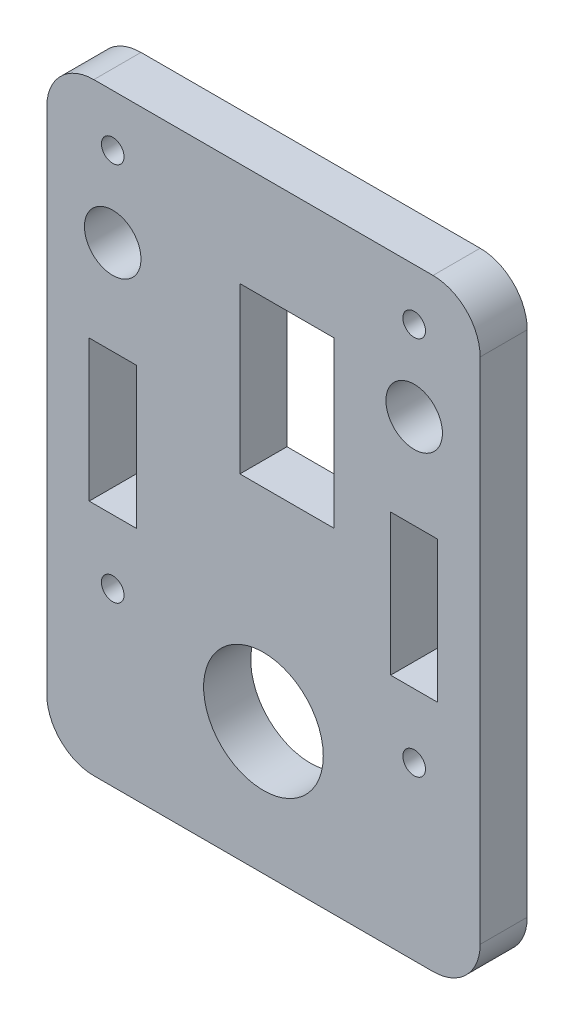
ISO-10303-21;
HEADER;
FILE_DESCRIPTION(('STEP AP214'),'2;1');
FILE_NAME('part.step','',(''),(''),'','','');
FILE_SCHEMA(('AUTOMOTIVE_DESIGN { 1 0 10303 214 1 1 1 1 }'));
ENDSEC;
DATA;
#1=APPLICATION_CONTEXT('core data for automotive mechanical design processes');
#2=APPLICATION_PROTOCOL_DEFINITION('international standard','automotive_design',2000,#1);
#3=PRODUCT_CONTEXT('',#1,'mechanical');
#4=PRODUCT('Part','Part','',(#3));
#5=PRODUCT_RELATED_PRODUCT_CATEGORY('part','',(#4));
#6=PRODUCT_DEFINITION_FORMATION('','',#4);
#7=PRODUCT_DEFINITION_CONTEXT('part definition',#1,'design');
#8=PRODUCT_DEFINITION('design','',#6,#7);
#9=PRODUCT_DEFINITION_SHAPE('','',#8);
#10=(LENGTH_UNIT() NAMED_UNIT(*) SI_UNIT(.MILLI.,.METRE.));
#11=(NAMED_UNIT(*) PLANE_ANGLE_UNIT() SI_UNIT($,.RADIAN.));
#12=(NAMED_UNIT(*) SI_UNIT($,.STERADIAN.) SOLID_ANGLE_UNIT());
#13=UNCERTAINTY_MEASURE_WITH_UNIT(LENGTH_MEASURE(1.E-05),#10,'distance_accuracy_value','');
#14=(GEOMETRIC_REPRESENTATION_CONTEXT(3) GLOBAL_UNCERTAINTY_ASSIGNED_CONTEXT((#13)) GLOBAL_UNIT_ASSIGNED_CONTEXT((#10,
#11,#12)) REPRESENTATION_CONTEXT('',''));
#15=CARTESIAN_POINT('',(0.,0.,0.));
#16=DIRECTION('',(0.,0.,1.));
#17=DIRECTION('',(1.,0.,0.));
#18=AXIS2_PLACEMENT_3D('',#15,#16,#17);
#19=CARTESIAN_POINT('',(23.,0.,5.));
#20=DIRECTION('',(0.,0.,-1.));
#21=DIRECTION('',(-1.,0.,0.));
#22=AXIS2_PLACEMENT_3D('',#19,#20,#21);
#23=PLANE('',#22);
#24=DIRECTION('',(-1.,0.,0.));
#25=VECTOR('',#24,1.);
#26=CARTESIAN_POINT('',(-13.5,40.,5.));
#27=LINE('',#26,#25);
#28=CARTESIAN_POINT('',(-13.5,40.,5.));
#29=VERTEX_POINT('',#28);
#30=CARTESIAN_POINT('',(-18.5,40.,5.));
#31=VERTEX_POINT('',#30);
#32=EDGE_CURVE('E169',#29,#31,#27,.T.);
#33=ORIENTED_EDGE('',*,*,#32,.F.);
#34=DIRECTION('',(0.,1.,0.));
#35=VECTOR('',#34,1.);
#36=CARTESIAN_POINT('',(-13.5,40.,5.));
#37=LINE('',#36,#35);
#38=CARTESIAN_POINT('',(-13.5,25.,5.));
#39=VERTEX_POINT('',#38);
#40=EDGE_CURVE('E195',#39,#29,#37,.T.);
#41=ORIENTED_EDGE('',*,*,#40,.F.);
#42=DIRECTION('',(1.,0.,0.));
#43=VECTOR('',#42,1.);
#44=CARTESIAN_POINT('',(-13.5,25.,5.));
#45=LINE('',#44,#43);
#46=CARTESIAN_POINT('',(-18.5,25.,5.));
#47=VERTEX_POINT('',#46);
#48=EDGE_CURVE('E193',#47,#39,#45,.T.);
#49=ORIENTED_EDGE('',*,*,#48,.F.);
#50=DIRECTION('',(0.,-1.,0.));
#51=VECTOR('',#50,1.);
#52=CARTESIAN_POINT('',(-18.5,40.,5.));
#53=LINE('',#52,#51);
#54=EDGE_CURVE('E179',#31,#47,#53,.T.);
#55=ORIENTED_EDGE('',*,*,#54,.F.);
#56=EDGE_LOOP('',(#33,#41,#49,#55));
#57=FACE_BOUND('',#56,.T.);
#58=CARTESIAN_POINT('',(-16.,18.2,5.));
#59=DIRECTION('',(0.,0.,1.));
#60=DIRECTION('',(-1.,0.,0.));
#61=AXIS2_PLACEMENT_3D('',#58,#59,#60);
#62=CIRCLE('',#61,1.2);
#63=CARTESIAN_POINT('',(-17.2,18.2,5.));
#64=VERTEX_POINT('',#63);
#65=EDGE_CURVE('E219',#64,#64,#62,.T.);
#66=ORIENTED_EDGE('',*,*,#65,.F.);
#67=EDGE_LOOP('',(#66));
#68=FACE_BOUND('',#67,.T.);
#69=DIRECTION('',(0.,-1.,0.));
#70=VECTOR('',#69,1.);
#71=CARTESIAN_POINT('',(-2.5,53.,5.));
#72=LINE('',#71,#70);
#73=CARTESIAN_POINT('',(-2.5,53.,5.));
#74=VERTEX_POINT('',#73);
#75=CARTESIAN_POINT('',(-2.5,35.5,5.));
#76=VERTEX_POINT('',#75);
#77=EDGE_CURVE('E231',#74,#76,#72,.T.);
#78=ORIENTED_EDGE('',*,*,#77,.F.);
#79=DIRECTION('',(-1.,0.,0.));
#80=VECTOR('',#79,1.);
#81=CARTESIAN_POINT('',(-2.5,53.,5.));
#82=LINE('',#81,#80);
#83=CARTESIAN_POINT('',(7.5,53.,5.));
#84=VERTEX_POINT('',#83);
#85=EDGE_CURVE('E239',#84,#74,#82,.T.);
#86=ORIENTED_EDGE('',*,*,#85,.F.);
#87=DIRECTION('',(0.,1.,0.));
#88=VECTOR('',#87,1.);
#89=CARTESIAN_POINT('',(7.5,53.,5.));
#90=LINE('',#89,#88);
#91=CARTESIAN_POINT('',(7.5,35.5,5.));
#92=VERTEX_POINT('',#91);
#93=EDGE_CURVE('E236',#92,#84,#90,.T.);
#94=ORIENTED_EDGE('',*,*,#93,.F.);
#95=DIRECTION('',(1.,0.,0.));
#96=VECTOR('',#95,1.);
#97=CARTESIAN_POINT('',(-2.5,35.5,5.));
#98=LINE('',#97,#96);
#99=EDGE_CURVE('E233',#76,#92,#98,.T.);
#100=ORIENTED_EDGE('',*,*,#99,.F.);
#101=EDGE_LOOP('',(#78,#86,#94,#100));
#102=FACE_BOUND('',#101,.T.);
#103=CARTESIAN_POINT('',(16.,18.2,5.));
#104=DIRECTION('',(0.,0.,1.));
#105=DIRECTION('',(1.,0.,0.));
#106=AXIS2_PLACEMENT_3D('',#103,#104,#105);
#107=CIRCLE('',#106,1.2);
#108=CARTESIAN_POINT('',(17.2,18.2,5.));
#109=VERTEX_POINT('',#108);
#110=EDGE_CURVE('E268',#109,#109,#107,.T.);
#111=ORIENTED_EDGE('',*,*,#110,.F.);
#112=EDGE_LOOP('',(#111));
#113=FACE_BOUND('',#112,.T.);
#114=CARTESIAN_POINT('',(16.,50.,5.));
#115=DIRECTION('',(0.,0.,1.));
#116=DIRECTION('',(1.,0.,0.));
#117=AXIS2_PLACEMENT_3D('',#114,#115,#116);
#118=CIRCLE('',#117,3.);
#119=CARTESIAN_POINT('',(19.,50.,5.));
#120=VERTEX_POINT('',#119);
#121=EDGE_CURVE('E305',#120,#120,#118,.T.);
#122=ORIENTED_EDGE('',*,*,#121,.F.);
#123=EDGE_LOOP('',(#122));
#124=FACE_BOUND('',#123,.T.);
#125=DIRECTION('',(0.,-1.,0.));
#126=VECTOR('',#125,1.);
#127=CARTESIAN_POINT('',(-23.,64.,5.));
#128=LINE('',#127,#126);
#129=CARTESIAN_POINT('',(-23.,59.,5.));
#130=VERTEX_POINT('',#129);
#131=CARTESIAN_POINT('',(-23.,5.,5.));
#132=VERTEX_POINT('',#131);
#133=EDGE_CURVE('E316',#130,#132,#128,.T.);
#134=ORIENTED_EDGE('',*,*,#133,.T.);
#135=CARTESIAN_POINT('',(-18.,5.,5.));
#136=DIRECTION('',(0.,0.,-1.));
#137=DIRECTION('',(-1.,0.,0.));
#138=AXIS2_PLACEMENT_3D('',#135,#136,#137);
#139=CIRCLE('',#138,5.);
#140=CARTESIAN_POINT('',(-18.,0.,5.));
#141=VERTEX_POINT('',#140);
#142=EDGE_CURVE('E354',#132,#141,#139,.F.);
#143=ORIENTED_EDGE('',*,*,#142,.T.);
#144=DIRECTION('',(1.,0.,0.));
#145=VECTOR('',#144,1.);
#146=CARTESIAN_POINT('',(23.,0.,5.));
#147=LINE('',#146,#145);
#148=CARTESIAN_POINT('',(18.,0.,5.));
#149=VERTEX_POINT('',#148);
#150=EDGE_CURVE('E319',#141,#149,#147,.T.);
#151=ORIENTED_EDGE('',*,*,#150,.T.);
#152=CARTESIAN_POINT('',(18.,5.,5.));
#153=DIRECTION('',(0.,0.,-1.));
#154=DIRECTION('',(-1.,0.,0.));
#155=AXIS2_PLACEMENT_3D('',#152,#153,#154);
#156=CIRCLE('',#155,5.);
#157=CARTESIAN_POINT('',(23.,5.,5.));
#158=VERTEX_POINT('',#157);
#159=EDGE_CURVE('E352',#149,#158,#156,.F.);
#160=ORIENTED_EDGE('',*,*,#159,.T.);
#161=DIRECTION('',(0.,1.,0.));
#162=VECTOR('',#161,1.);
#163=CARTESIAN_POINT('',(23.,64.,5.));
#164=LINE('',#163,#162);
#165=CARTESIAN_POINT('',(23.,59.,5.));
#166=VERTEX_POINT('',#165);
#167=EDGE_CURVE('E311',#158,#166,#164,.T.);
#168=ORIENTED_EDGE('',*,*,#167,.T.);
#169=CARTESIAN_POINT('',(18.,59.,5.));
#170=DIRECTION('',(0.,0.,-1.));
#171=DIRECTION('',(-1.,0.,0.));
#172=AXIS2_PLACEMENT_3D('',#169,#170,#171);
#173=CIRCLE('',#172,5.);
#174=CARTESIAN_POINT('',(18.,64.,5.));
#175=VERTEX_POINT('',#174);
#176=EDGE_CURVE('E51',#166,#175,#173,.F.);
#177=ORIENTED_EDGE('',*,*,#176,.T.);
#178=DIRECTION('',(-1.,0.,0.));
#179=VECTOR('',#178,1.);
#180=CARTESIAN_POINT('',(-23.,64.,5.));
#181=LINE('',#180,#179);
#182=CARTESIAN_POINT('',(-18.,64.,5.));
#183=VERTEX_POINT('',#182);
#184=EDGE_CURVE('E313',#175,#183,#181,.T.);
#185=ORIENTED_EDGE('',*,*,#184,.T.);
#186=CARTESIAN_POINT('',(-18.,59.,5.));
#187=DIRECTION('',(0.,0.,-1.));
#188=DIRECTION('',(-1.,0.,0.));
#189=AXIS2_PLACEMENT_3D('',#186,#187,#188);
#190=CIRCLE('',#189,5.);
#191=EDGE_CURVE('E349',#183,#130,#190,.F.);
#192=ORIENTED_EDGE('',*,*,#191,.T.);
#193=EDGE_LOOP('',(#134,#143,#151,#160,#168,#177,#185,#192));
#194=FACE_BOUND('',#193,.T.);
#195=DIRECTION('',(0.,-1.,0.));
#196=VECTOR('',#195,1.);
#197=CARTESIAN_POINT('',(13.5,40.,5.));
#198=LINE('',#197,#196);
#199=CARTESIAN_POINT('',(13.5,40.,5.));
#200=VERTEX_POINT('',#199);
#201=CARTESIAN_POINT('',(13.5,25.,5.));
#202=VERTEX_POINT('',#201);
#203=EDGE_CURVE('E274',#200,#202,#198,.T.);
#204=ORIENTED_EDGE('',*,*,#203,.F.);
#205=DIRECTION('',(-1.,0.,0.));
#206=VECTOR('',#205,1.);
#207=CARTESIAN_POINT('',(13.5,40.,5.));
#208=LINE('',#207,#206);
#209=CARTESIAN_POINT('',(18.5,40.,5.));
#210=VERTEX_POINT('',#209);
#211=EDGE_CURVE('E282',#210,#200,#208,.T.);
#212=ORIENTED_EDGE('',*,*,#211,.F.);
#213=DIRECTION('',(0.,1.,0.));
#214=VECTOR('',#213,1.);
#215=CARTESIAN_POINT('',(18.5,40.,5.));
#216=LINE('',#215,#214);
#217=CARTESIAN_POINT('',(18.5,25.,5.));
#218=VERTEX_POINT('',#217);
#219=EDGE_CURVE('E279',#218,#210,#216,.T.);
#220=ORIENTED_EDGE('',*,*,#219,.F.);
#221=DIRECTION('',(1.,0.,0.));
#222=VECTOR('',#221,1.);
#223=CARTESIAN_POINT('',(13.5,25.,5.));
#224=LINE('',#223,#222);
#225=EDGE_CURVE('E276',#202,#218,#224,.T.);
#226=ORIENTED_EDGE('',*,*,#225,.F.);
#227=EDGE_LOOP('',(#204,#212,#220,#226));
#228=FACE_BOUND('',#227,.T.);
#229=CARTESIAN_POINT('',(16.,58.5,5.));
#230=DIRECTION('',(0.,0.,1.));
#231=DIRECTION('',(1.,0.,0.));
#232=AXIS2_PLACEMENT_3D('',#229,#230,#231);
#233=CIRCLE('',#232,1.2);
#234=CARTESIAN_POINT('',(17.2,58.5,5.));
#235=VERTEX_POINT('',#234);
#236=EDGE_CURVE('E262',#235,#235,#233,.T.);
#237=ORIENTED_EDGE('',*,*,#236,.F.);
#238=EDGE_LOOP('',(#237));
#239=FACE_BOUND('',#238,.T.);
#240=CARTESIAN_POINT('',(-16.,58.5,5.));
#241=DIRECTION('',(0.,0.,1.));
#242=DIRECTION('',(-1.,0.,0.));
#243=AXIS2_PLACEMENT_3D('',#240,#241,#242);
#244=CIRCLE('',#243,1.2);
#245=CARTESIAN_POINT('',(-17.2,58.5,5.));
#246=VERTEX_POINT('',#245);
#247=EDGE_CURVE('E225',#246,#246,#244,.T.);
#248=ORIENTED_EDGE('',*,*,#247,.F.);
#249=EDGE_LOOP('',(#248));
#250=FACE_BOUND('',#249,.T.);
#251=CARTESIAN_POINT('',(-16.,50.,5.));
#252=DIRECTION('',(0.,0.,1.));
#253=DIRECTION('',(-1.,0.,0.));
#254=AXIS2_PLACEMENT_3D('',#251,#252,#253);
#255=CIRCLE('',#254,3.00000000000001);
#256=CARTESIAN_POINT('',(-19.,50.,5.));
#257=VERTEX_POINT('',#256);
#258=EDGE_CURVE('E213',#257,#257,#255,.T.);
#259=ORIENTED_EDGE('',*,*,#258,.F.);
#260=EDGE_LOOP('',(#259));
#261=FACE_BOUND('',#260,.T.);
#262=CARTESIAN_POINT('',(0.,14.,5.));
#263=DIRECTION('',(0.,0.,1.));
#264=DIRECTION('',(1.,0.,0.));
#265=AXIS2_PLACEMENT_3D('',#262,#263,#264);
#266=CIRCLE('',#265,6.35);
#267=CARTESIAN_POINT('',(6.35,14.,5.));
#268=VERTEX_POINT('',#267);
#269=EDGE_CURVE('E202',#268,#268,#266,.T.);
#270=ORIENTED_EDGE('',*,*,#269,.F.);
#271=EDGE_LOOP('',(#270));
#272=FACE_BOUND('',#271,.T.);
#273=ADVANCED_FACE('F30',(#57,#68,#102,#113,#124,#194,#228,#239,#250,#261,#272),#23,.F.);
#274=CARTESIAN_POINT('',(23.,0.,0.));
#275=DIRECTION('',(0.,0.,-1.));
#276=DIRECTION('',(-1.,0.,0.));
#277=AXIS2_PLACEMENT_3D('',#274,#275,#276);
#278=PLANE('',#277);
#279=DIRECTION('',(0.,1.,0.));
#280=VECTOR('',#279,1.);
#281=CARTESIAN_POINT('',(-13.5,40.,0.));
#282=LINE('',#281,#280);
#283=CARTESIAN_POINT('',(-13.5,25.,0.));
#284=VERTEX_POINT('',#283);
#285=CARTESIAN_POINT('',(-13.5,40.,0.));
#286=VERTEX_POINT('',#285);
#287=EDGE_CURVE('E180',#284,#286,#282,.T.);
#288=ORIENTED_EDGE('',*,*,#287,.T.);
#289=DIRECTION('',(-1.,0.,0.));
#290=VECTOR('',#289,1.);
#291=CARTESIAN_POINT('',(-13.5,40.,0.));
#292=LINE('',#291,#290);
#293=CARTESIAN_POINT('',(-18.5,40.,0.));
#294=VERTEX_POINT('',#293);
#295=EDGE_CURVE('E200',#286,#294,#292,.T.);
#296=ORIENTED_EDGE('',*,*,#295,.T.);
#297=DIRECTION('',(0.,-1.,0.));
#298=VECTOR('',#297,1.);
#299=CARTESIAN_POINT('',(-18.5,40.,0.));
#300=LINE('',#299,#298);
#301=CARTESIAN_POINT('',(-18.5,25.,0.));
#302=VERTEX_POINT('',#301);
#303=EDGE_CURVE('E186',#294,#302,#300,.T.);
#304=ORIENTED_EDGE('',*,*,#303,.T.);
#305=DIRECTION('',(1.,0.,0.));
#306=VECTOR('',#305,1.);
#307=CARTESIAN_POINT('',(-13.5,25.,0.));
#308=LINE('',#307,#306);
#309=EDGE_CURVE('E204',#302,#284,#308,.T.);
#310=ORIENTED_EDGE('',*,*,#309,.T.);
#311=EDGE_LOOP('',(#288,#296,#304,#310));
#312=FACE_BOUND('',#311,.T.);
#313=CARTESIAN_POINT('',(-16.,18.2,0.));
#314=DIRECTION('',(0.,0.,1.));
#315=DIRECTION('',(-1.,0.,0.));
#316=AXIS2_PLACEMENT_3D('',#313,#314,#315);
#317=CIRCLE('',#316,1.2);
#318=CARTESIAN_POINT('',(-17.2,18.2,0.));
#319=VERTEX_POINT('',#318);
#320=EDGE_CURVE('E216',#319,#319,#317,.T.);
#321=ORIENTED_EDGE('',*,*,#320,.T.);
#322=EDGE_LOOP('',(#321));
#323=FACE_BOUND('',#322,.T.);
#324=DIRECTION('',(-1.,0.,0.));
#325=VECTOR('',#324,1.);
#326=CARTESIAN_POINT('',(-2.5,53.,0.));
#327=LINE('',#326,#325);
#328=CARTESIAN_POINT('',(7.5,53.,0.));
#329=VERTEX_POINT('',#328);
#330=CARTESIAN_POINT('',(-2.5,53.,0.));
#331=VERTEX_POINT('',#330);
#332=EDGE_CURVE('E234',#329,#331,#327,.T.);
#333=ORIENTED_EDGE('',*,*,#332,.T.);
#334=DIRECTION('',(0.,-1.,0.));
#335=VECTOR('',#334,1.);
#336=CARTESIAN_POINT('',(-2.5,53.,0.));
#337=LINE('',#336,#335);
#338=CARTESIAN_POINT('',(-2.5,35.5,0.));
#339=VERTEX_POINT('',#338);
#340=EDGE_CURVE('E228',#331,#339,#337,.T.);
#341=ORIENTED_EDGE('',*,*,#340,.T.);
#342=DIRECTION('',(1.,0.,0.));
#343=VECTOR('',#342,1.);
#344=CARTESIAN_POINT('',(-2.5,35.5,0.));
#345=LINE('',#344,#343);
#346=CARTESIAN_POINT('',(7.5,35.5,0.));
#347=VERTEX_POINT('',#346);
#348=EDGE_CURVE('E244',#339,#347,#345,.T.);
#349=ORIENTED_EDGE('',*,*,#348,.T.);
#350=DIRECTION('',(0.,1.,0.));
#351=VECTOR('',#350,1.);
#352=CARTESIAN_POINT('',(7.5,53.,0.));
#353=LINE('',#352,#351);
#354=EDGE_CURVE('E247',#347,#329,#353,.T.);
#355=ORIENTED_EDGE('',*,*,#354,.T.);
#356=EDGE_LOOP('',(#333,#341,#349,#355));
#357=FACE_BOUND('',#356,.T.);
#358=CARTESIAN_POINT('',(16.,18.2,0.));
#359=DIRECTION('',(0.,0.,1.));
#360=DIRECTION('',(1.,0.,0.));
#361=AXIS2_PLACEMENT_3D('',#358,#359,#360);
#362=CIRCLE('',#361,1.2);
#363=CARTESIAN_POINT('',(17.2,18.2,0.));
#364=VERTEX_POINT('',#363);
#365=EDGE_CURVE('E265',#364,#364,#362,.T.);
#366=ORIENTED_EDGE('',*,*,#365,.T.);
#367=EDGE_LOOP('',(#366));
#368=FACE_BOUND('',#367,.T.);
#369=CARTESIAN_POINT('',(16.,50.,0.));
#370=DIRECTION('',(0.,0.,1.));
#371=DIRECTION('',(1.,0.,0.));
#372=AXIS2_PLACEMENT_3D('',#369,#370,#371);
#373=CIRCLE('',#372,3.);
#374=CARTESIAN_POINT('',(19.,50.,0.));
#375=VERTEX_POINT('',#374);
#376=EDGE_CURVE('E304',#375,#375,#373,.T.);
#377=ORIENTED_EDGE('',*,*,#376,.T.);
#378=EDGE_LOOP('',(#377));
#379=FACE_BOUND('',#378,.T.);
#380=DIRECTION('',(1.,0.,0.));
#381=VECTOR('',#380,1.);
#382=CARTESIAN_POINT('',(23.,0.,0.));
#383=LINE('',#382,#381);
#384=CARTESIAN_POINT('',(-18.,0.,0.));
#385=VERTEX_POINT('',#384);
#386=CARTESIAN_POINT('',(18.,0.,0.));
#387=VERTEX_POINT('',#386);
#388=EDGE_CURVE('E314',#385,#387,#383,.T.);
#389=ORIENTED_EDGE('',*,*,#388,.F.);
#390=CARTESIAN_POINT('',(-18.,5.,0.));
#391=DIRECTION('',(0.,0.,-1.));
#392=DIRECTION('',(-1.,0.,0.));
#393=AXIS2_PLACEMENT_3D('',#390,#391,#392);
#394=CIRCLE('',#393,5.);
#395=CARTESIAN_POINT('',(-23.,5.,0.));
#396=VERTEX_POINT('',#395);
#397=EDGE_CURVE('E342',#385,#396,#394,.T.);
#398=ORIENTED_EDGE('',*,*,#397,.T.);
#399=DIRECTION('',(0.,-1.,0.));
#400=VECTOR('',#399,1.);
#401=CARTESIAN_POINT('',(-23.,64.,0.));
#402=LINE('',#401,#400);
#403=CARTESIAN_POINT('',(-23.,59.,0.));
#404=VERTEX_POINT('',#403);
#405=EDGE_CURVE('E327',#404,#396,#402,.T.);
#406=ORIENTED_EDGE('',*,*,#405,.F.);
#407=CARTESIAN_POINT('',(-18.,59.,0.));
#408=DIRECTION('',(0.,0.,-1.));
#409=DIRECTION('',(-1.,0.,0.));
#410=AXIS2_PLACEMENT_3D('',#407,#408,#409);
#411=CIRCLE('',#410,5.);
#412=CARTESIAN_POINT('',(-18.,64.,0.));
#413=VERTEX_POINT('',#412);
#414=EDGE_CURVE('E336',#404,#413,#411,.T.);
#415=ORIENTED_EDGE('',*,*,#414,.T.);
#416=DIRECTION('',(-1.,0.,0.));
#417=VECTOR('',#416,1.);
#418=CARTESIAN_POINT('',(-23.,64.,0.));
#419=LINE('',#418,#417);
#420=CARTESIAN_POINT('',(18.,64.,0.));
#421=VERTEX_POINT('',#420);
#422=EDGE_CURVE('E325',#421,#413,#419,.T.);
#423=ORIENTED_EDGE('',*,*,#422,.F.);
#424=CARTESIAN_POINT('',(18.,59.,0.));
#425=DIRECTION('',(0.,0.,-1.));
#426=DIRECTION('',(-1.,0.,0.));
#427=AXIS2_PLACEMENT_3D('',#424,#425,#426);
#428=CIRCLE('',#427,5.);
#429=CARTESIAN_POINT('',(23.,59.,0.));
#430=VERTEX_POINT('',#429);
#431=EDGE_CURVE('E338',#421,#430,#428,.T.);
#432=ORIENTED_EDGE('',*,*,#431,.T.);
#433=DIRECTION('',(0.,1.,0.));
#434=VECTOR('',#433,1.);
#435=CARTESIAN_POINT('',(23.,64.,0.));
#436=LINE('',#435,#434);
#437=CARTESIAN_POINT('',(23.,5.,0.));
#438=VERTEX_POINT('',#437);
#439=EDGE_CURVE('E308',#438,#430,#436,.T.);
#440=ORIENTED_EDGE('',*,*,#439,.F.);
#441=CARTESIAN_POINT('',(18.,5.,0.));
#442=DIRECTION('',(0.,0.,-1.));
#443=DIRECTION('',(-1.,0.,0.));
#444=AXIS2_PLACEMENT_3D('',#441,#442,#443);
#445=CIRCLE('',#444,5.);
#446=EDGE_CURVE('E340',#438,#387,#445,.T.);
#447=ORIENTED_EDGE('',*,*,#446,.T.);
#448=EDGE_LOOP('',(#389,#398,#406,#415,#423,#432,#440,#447));
#449=FACE_BOUND('',#448,.T.);
#450=DIRECTION('',(-1.,0.,0.));
#451=VECTOR('',#450,1.);
#452=CARTESIAN_POINT('',(13.5,40.,0.));
#453=LINE('',#452,#451);
#454=CARTESIAN_POINT('',(18.5,40.,0.));
#455=VERTEX_POINT('',#454);
#456=CARTESIAN_POINT('',(13.5,40.,0.));
#457=VERTEX_POINT('',#456);
#458=EDGE_CURVE('E277',#455,#457,#453,.T.);
#459=ORIENTED_EDGE('',*,*,#458,.T.);
#460=DIRECTION('',(0.,-1.,0.));
#461=VECTOR('',#460,1.);
#462=CARTESIAN_POINT('',(13.5,40.,0.));
#463=LINE('',#462,#461);
#464=CARTESIAN_POINT('',(13.5,25.,0.));
#465=VERTEX_POINT('',#464);
#466=EDGE_CURVE('E271',#457,#465,#463,.T.);
#467=ORIENTED_EDGE('',*,*,#466,.T.);
#468=DIRECTION('',(1.,0.,0.));
#469=VECTOR('',#468,1.);
#470=CARTESIAN_POINT('',(13.5,25.,0.));
#471=LINE('',#470,#469);
#472=CARTESIAN_POINT('',(18.5,25.,0.));
#473=VERTEX_POINT('',#472);
#474=EDGE_CURVE('E287',#465,#473,#471,.T.);
#475=ORIENTED_EDGE('',*,*,#474,.T.);
#476=DIRECTION('',(0.,1.,0.));
#477=VECTOR('',#476,1.);
#478=CARTESIAN_POINT('',(18.5,40.,0.));
#479=LINE('',#478,#477);
#480=EDGE_CURVE('E290',#473,#455,#479,.T.);
#481=ORIENTED_EDGE('',*,*,#480,.T.);
#482=EDGE_LOOP('',(#459,#467,#475,#481));
#483=FACE_BOUND('',#482,.T.);
#484=CARTESIAN_POINT('',(16.,58.5,0.));
#485=DIRECTION('',(0.,0.,1.));
#486=DIRECTION('',(1.,0.,0.));
#487=AXIS2_PLACEMENT_3D('',#484,#485,#486);
#488=CIRCLE('',#487,1.2);
#489=CARTESIAN_POINT('',(17.2,58.5,0.));
#490=VERTEX_POINT('',#489);
#491=EDGE_CURVE('E261',#490,#490,#488,.T.);
#492=ORIENTED_EDGE('',*,*,#491,.T.);
#493=EDGE_LOOP('',(#492));
#494=FACE_BOUND('',#493,.T.);
#495=CARTESIAN_POINT('',(-16.,58.5,0.));
#496=DIRECTION('',(0.,0.,1.));
#497=DIRECTION('',(-1.,0.,0.));
#498=AXIS2_PLACEMENT_3D('',#495,#496,#497);
#499=CIRCLE('',#498,1.2);
#500=CARTESIAN_POINT('',(-17.2,58.5,0.));
#501=VERTEX_POINT('',#500);
#502=EDGE_CURVE('E222',#501,#501,#499,.T.);
#503=ORIENTED_EDGE('',*,*,#502,.T.);
#504=EDGE_LOOP('',(#503));
#505=FACE_BOUND('',#504,.T.);
#506=CARTESIAN_POINT('',(-16.,50.,0.));
#507=DIRECTION('',(0.,0.,1.));
#508=DIRECTION('',(-1.,0.,0.));
#509=AXIS2_PLACEMENT_3D('',#506,#507,#508);
#510=CIRCLE('',#509,3.00000000000001);
#511=CARTESIAN_POINT('',(-19.,50.,0.));
#512=VERTEX_POINT('',#511);
#513=EDGE_CURVE('E187',#512,#512,#510,.T.);
#514=ORIENTED_EDGE('',*,*,#513,.T.);
#515=EDGE_LOOP('',(#514));
#516=FACE_BOUND('',#515,.T.);
#517=CARTESIAN_POINT('',(0.,14.,0.));
#518=DIRECTION('',(0.,0.,1.));
#519=DIRECTION('',(1.,0.,0.));
#520=AXIS2_PLACEMENT_3D('',#517,#518,#519);
#521=CIRCLE('',#520,6.35);
#522=CARTESIAN_POINT('',(6.35,14.,0.));
#523=VERTEX_POINT('',#522);
#524=EDGE_CURVE('E665',#523,#523,#521,.T.);
#525=ORIENTED_EDGE('',*,*,#524,.T.);
#526=EDGE_LOOP('',(#525));
#527=FACE_BOUND('',#526,.T.);
#528=ADVANCED_FACE('F370',(#312,#323,#357,#368,#379,#449,#483,#494,#505,#516,#527),#278,.T.);
#529=CARTESIAN_POINT('',(23.,64.,5.));
#530=DIRECTION('',(-1.,0.,0.));
#531=DIRECTION('',(0.,-1.,0.));
#532=AXIS2_PLACEMENT_3D('',#529,#530,#531);
#533=PLANE('',#532);
#534=ORIENTED_EDGE('',*,*,#167,.F.);
#535=DIRECTION('',(0.,0.,-1.));
#536=VECTOR('',#535,1.);
#537=CARTESIAN_POINT('',(23.,5.,5.));
#538=LINE('',#537,#536);
#539=EDGE_CURVE('E358',#158,#438,#538,.T.);
#540=ORIENTED_EDGE('',*,*,#539,.T.);
#541=ORIENTED_EDGE('',*,*,#439,.T.);
#542=DIRECTION('',(0.,0.,-1.));
#543=VECTOR('',#542,1.);
#544=CARTESIAN_POINT('',(23.,59.,5.));
#545=LINE('',#544,#543);
#546=EDGE_CURVE('E356',#430,#166,#545,.F.);
#547=ORIENTED_EDGE('',*,*,#546,.T.);
#548=EDGE_LOOP('',(#534,#540,#541,#547));
#549=FACE_BOUND('',#548,.T.);
#550=ADVANCED_FACE('F364',(#549),#533,.F.);
#551=CARTESIAN_POINT('',(-23.,64.,5.));
#552=DIRECTION('',(0.,-1.,0.));
#553=DIRECTION('',(0.,0.,-1.));
#554=AXIS2_PLACEMENT_3D('',#551,#552,#553);
#555=PLANE('',#554);
#556=ORIENTED_EDGE('',*,*,#184,.F.);
#557=DIRECTION('',(0.,0.,-1.));
#558=VECTOR('',#557,1.);
#559=CARTESIAN_POINT('',(18.,64.,5.));
#560=LINE('',#559,#558);
#561=EDGE_CURVE('E11',#175,#421,#560,.T.);
#562=ORIENTED_EDGE('',*,*,#561,.T.);
#563=ORIENTED_EDGE('',*,*,#422,.T.);
#564=DIRECTION('',(0.,0.,-1.));
#565=VECTOR('',#564,1.);
#566=CARTESIAN_POINT('',(-18.,64.,5.));
#567=LINE('',#566,#565);
#568=EDGE_CURVE('E38',#413,#183,#567,.F.);
#569=ORIENTED_EDGE('',*,*,#568,.T.);
#570=EDGE_LOOP('',(#556,#562,#563,#569));
#571=FACE_BOUND('',#570,.T.);
#572=ADVANCED_FACE('F376',(#571),#555,.F.);
#573=CARTESIAN_POINT('',(-23.,64.,5.));
#574=DIRECTION('',(1.,0.,0.));
#575=DIRECTION('',(0.,1.,0.));
#576=AXIS2_PLACEMENT_3D('',#573,#574,#575);
#577=PLANE('',#576);
#578=ORIENTED_EDGE('',*,*,#405,.T.);
#579=DIRECTION('',(0.,0.,-1.));
#580=VECTOR('',#579,1.);
#581=CARTESIAN_POINT('',(-23.,5.,5.));
#582=LINE('',#581,#580);
#583=EDGE_CURVE('E347',#396,#132,#582,.F.);
#584=ORIENTED_EDGE('',*,*,#583,.T.);
#585=ORIENTED_EDGE('',*,*,#133,.F.);
#586=DIRECTION('',(0.,0.,-1.));
#587=VECTOR('',#586,1.);
#588=CARTESIAN_POINT('',(-23.,59.,5.));
#589=LINE('',#588,#587);
#590=EDGE_CURVE('E344',#130,#404,#589,.T.);
#591=ORIENTED_EDGE('',*,*,#590,.T.);
#592=EDGE_LOOP('',(#578,#584,#585,#591));
#593=FACE_BOUND('',#592,.T.);
#594=ADVANCED_FACE('F384',(#593),#577,.F.);
#595=CARTESIAN_POINT('',(23.,0.,5.));
#596=DIRECTION('',(0.,1.,0.));
#597=DIRECTION('',(0.,0.,1.));
#598=AXIS2_PLACEMENT_3D('',#595,#596,#597);
#599=PLANE('',#598);
#600=ORIENTED_EDGE('',*,*,#150,.F.);
#601=DIRECTION('',(0.,0.,-1.));
#602=VECTOR('',#601,1.);
#603=CARTESIAN_POINT('',(-18.,0.,5.));
#604=LINE('',#603,#602);
#605=EDGE_CURVE('E333',#141,#385,#604,.T.);
#606=ORIENTED_EDGE('',*,*,#605,.T.);
#607=ORIENTED_EDGE('',*,*,#388,.T.);
#608=DIRECTION('',(0.,0.,-1.));
#609=VECTOR('',#608,1.);
#610=CARTESIAN_POINT('',(18.,0.,5.));
#611=LINE('',#610,#609);
#612=EDGE_CURVE('E322',#387,#149,#611,.F.);
#613=ORIENTED_EDGE('',*,*,#612,.T.);
#614=EDGE_LOOP('',(#600,#606,#607,#613));
#615=FACE_BOUND('',#614,.T.);
#616=ADVANCED_FACE('F392',(#615),#599,.F.);
#617=CARTESIAN_POINT('',(16.,50.,5.));
#618=DIRECTION('',(0.,0.,-1.));
#619=DIRECTION('',(-1.,0.,0.));
#620=AXIS2_PLACEMENT_3D('',#617,#618,#619);
#621=CYLINDRICAL_SURFACE('',#620,3.);
#622=ORIENTED_EDGE('',*,*,#121,.T.);
#623=EDGE_LOOP('',(#622));
#624=FACE_BOUND('',#623,.T.);
#625=ORIENTED_EDGE('',*,*,#376,.F.);
#626=EDGE_LOOP('',(#625));
#627=FACE_BOUND('',#626,.T.);
#628=ADVANCED_FACE('F411',(#624,#627),#621,.F.);
#629=CARTESIAN_POINT('',(13.5,40.,5.));
#630=DIRECTION('',(1.,0.,0.));
#631=DIRECTION('',(0.,1.,0.));
#632=AXIS2_PLACEMENT_3D('',#629,#630,#631);
#633=PLANE('',#632);
#634=ORIENTED_EDGE('',*,*,#466,.F.);
#635=DIRECTION('',(0.,0.,-1.));
#636=VECTOR('',#635,1.);
#637=CARTESIAN_POINT('',(13.5,40.,5.));
#638=LINE('',#637,#636);
#639=EDGE_CURVE('E284',#200,#457,#638,.T.);
#640=ORIENTED_EDGE('',*,*,#639,.F.);
#641=ORIENTED_EDGE('',*,*,#203,.T.);
#642=DIRECTION('',(0.,0.,-1.));
#643=VECTOR('',#642,1.);
#644=CARTESIAN_POINT('',(13.5,25.,5.));
#645=LINE('',#644,#643);
#646=EDGE_CURVE('E301',#202,#465,#645,.T.);
#647=ORIENTED_EDGE('',*,*,#646,.T.);
#648=EDGE_LOOP('',(#634,#640,#641,#647));
#649=FACE_BOUND('',#648,.T.);
#650=ADVANCED_FACE('F444',(#649),#633,.T.);
#651=CARTESIAN_POINT('',(13.5,25.,5.));
#652=DIRECTION('',(0.,1.,0.));
#653=DIRECTION('',(0.,0.,1.));
#654=AXIS2_PLACEMENT_3D('',#651,#652,#653);
#655=PLANE('',#654);
#656=ORIENTED_EDGE('',*,*,#474,.F.);
#657=ORIENTED_EDGE('',*,*,#646,.F.);
#658=ORIENTED_EDGE('',*,*,#225,.T.);
#659=DIRECTION('',(0.,0.,-1.));
#660=VECTOR('',#659,1.);
#661=CARTESIAN_POINT('',(18.5,25.,5.));
#662=LINE('',#661,#660);
#663=EDGE_CURVE('E299',#218,#473,#662,.T.);
#664=ORIENTED_EDGE('',*,*,#663,.T.);
#665=EDGE_LOOP('',(#656,#657,#658,#664));
#666=FACE_BOUND('',#665,.T.);
#667=ADVANCED_FACE('F451',(#666),#655,.T.);
#668=CARTESIAN_POINT('',(18.5,40.,5.));
#669=DIRECTION('',(-1.,0.,0.));
#670=DIRECTION('',(0.,0.,1.));
#671=AXIS2_PLACEMENT_3D('',#668,#669,#670);
#672=PLANE('',#671);
#673=ORIENTED_EDGE('',*,*,#480,.F.);
#674=ORIENTED_EDGE('',*,*,#663,.F.);
#675=ORIENTED_EDGE('',*,*,#219,.T.);
#676=DIRECTION('',(0.,0.,-1.));
#677=VECTOR('',#676,1.);
#678=CARTESIAN_POINT('',(18.5,40.,5.));
#679=LINE('',#678,#677);
#680=EDGE_CURVE('E297',#210,#455,#679,.T.);
#681=ORIENTED_EDGE('',*,*,#680,.T.);
#682=EDGE_LOOP('',(#673,#674,#675,#681));
#683=FACE_BOUND('',#682,.T.);
#684=ADVANCED_FACE('F458',(#683),#672,.T.);
#685=CARTESIAN_POINT('',(13.5,40.,5.));
#686=DIRECTION('',(0.,-1.,0.));
#687=DIRECTION('',(0.,0.,-1.));
#688=AXIS2_PLACEMENT_3D('',#685,#686,#687);
#689=PLANE('',#688);
#690=ORIENTED_EDGE('',*,*,#458,.F.);
#691=ORIENTED_EDGE('',*,*,#680,.F.);
#692=ORIENTED_EDGE('',*,*,#211,.T.);
#693=ORIENTED_EDGE('',*,*,#639,.T.);
#694=EDGE_LOOP('',(#690,#691,#692,#693));
#695=FACE_BOUND('',#694,.T.);
#696=ADVANCED_FACE('F466',(#695),#689,.T.);
#697=CARTESIAN_POINT('',(16.,18.2,5.));
#698=DIRECTION('',(0.,0.,-1.));
#699=DIRECTION('',(-1.,0.,0.));
#700=AXIS2_PLACEMENT_3D('',#697,#698,#699);
#701=CYLINDRICAL_SURFACE('',#700,1.2);
#702=ORIENTED_EDGE('',*,*,#110,.T.);
#703=EDGE_LOOP('',(#702));
#704=FACE_BOUND('',#703,.T.);
#705=ORIENTED_EDGE('',*,*,#365,.F.);
#706=EDGE_LOOP('',(#705));
#707=FACE_BOUND('',#706,.T.);
#708=ADVANCED_FACE('F474',(#704,#707),#701,.F.);
#709=CARTESIAN_POINT('',(16.,58.5,5.));
#710=DIRECTION('',(0.,0.,-1.));
#711=DIRECTION('',(-1.,0.,0.));
#712=AXIS2_PLACEMENT_3D('',#709,#710,#711);
#713=CYLINDRICAL_SURFACE('',#712,1.2);
#714=ORIENTED_EDGE('',*,*,#236,.T.);
#715=EDGE_LOOP('',(#714));
#716=FACE_BOUND('',#715,.T.);
#717=ORIENTED_EDGE('',*,*,#491,.F.);
#718=EDGE_LOOP('',(#717));
#719=FACE_BOUND('',#718,.T.);
#720=ADVANCED_FACE('F482',(#716,#719),#713,.F.);
#721=CARTESIAN_POINT('',(-2.5,53.,5.));
#722=DIRECTION('',(1.,0.,0.));
#723=DIRECTION('',(0.,1.,0.));
#724=AXIS2_PLACEMENT_3D('',#721,#722,#723);
#725=PLANE('',#724);
#726=ORIENTED_EDGE('',*,*,#340,.F.);
#727=DIRECTION('',(0.,0.,-1.));
#728=VECTOR('',#727,1.);
#729=CARTESIAN_POINT('',(-2.5,53.,5.));
#730=LINE('',#729,#728);
#731=EDGE_CURVE('E241',#74,#331,#730,.T.);
#732=ORIENTED_EDGE('',*,*,#731,.F.);
#733=ORIENTED_EDGE('',*,*,#77,.T.);
#734=DIRECTION('',(0.,0.,-1.));
#735=VECTOR('',#734,1.);
#736=CARTESIAN_POINT('',(-2.5,35.5,5.));
#737=LINE('',#736,#735);
#738=EDGE_CURVE('E258',#76,#339,#737,.T.);
#739=ORIENTED_EDGE('',*,*,#738,.T.);
#740=EDGE_LOOP('',(#726,#732,#733,#739));
#741=FACE_BOUND('',#740,.T.);
#742=ADVANCED_FACE('F490',(#741),#725,.T.);
#743=CARTESIAN_POINT('',(-2.5,35.5,5.));
#744=DIRECTION('',(0.,1.,0.));
#745=DIRECTION('',(0.,0.,1.));
#746=AXIS2_PLACEMENT_3D('',#743,#744,#745);
#747=PLANE('',#746);
#748=ORIENTED_EDGE('',*,*,#348,.F.);
#749=ORIENTED_EDGE('',*,*,#738,.F.);
#750=ORIENTED_EDGE('',*,*,#99,.T.);
#751=DIRECTION('',(0.,0.,-1.));
#752=VECTOR('',#751,1.);
#753=CARTESIAN_POINT('',(7.5,35.5,5.));
#754=LINE('',#753,#752);
#755=EDGE_CURVE('E256',#92,#347,#754,.T.);
#756=ORIENTED_EDGE('',*,*,#755,.T.);
#757=EDGE_LOOP('',(#748,#749,#750,#756));
#758=FACE_BOUND('',#757,.T.);
#759=ADVANCED_FACE('F498',(#758),#747,.T.);
#760=CARTESIAN_POINT('',(7.5,53.,5.));
#761=DIRECTION('',(-1.,0.,0.));
#762=DIRECTION('',(0.,-1.,0.));
#763=AXIS2_PLACEMENT_3D('',#760,#761,#762);
#764=PLANE('',#763);
#765=ORIENTED_EDGE('',*,*,#354,.F.);
#766=ORIENTED_EDGE('',*,*,#755,.F.);
#767=ORIENTED_EDGE('',*,*,#93,.T.);
#768=DIRECTION('',(0.,0.,-1.));
#769=VECTOR('',#768,1.);
#770=CARTESIAN_POINT('',(7.5,53.,5.));
#771=LINE('',#770,#769);
#772=EDGE_CURVE('E254',#84,#329,#771,.T.);
#773=ORIENTED_EDGE('',*,*,#772,.T.);
#774=EDGE_LOOP('',(#765,#766,#767,#773));
#775=FACE_BOUND('',#774,.T.);
#776=ADVANCED_FACE('F506',(#775),#764,.T.);
#777=CARTESIAN_POINT('',(-2.5,53.,5.));
#778=DIRECTION('',(0.,-1.,0.));
#779=DIRECTION('',(0.,0.,-1.));
#780=AXIS2_PLACEMENT_3D('',#777,#778,#779);
#781=PLANE('',#780);
#782=ORIENTED_EDGE('',*,*,#332,.F.);
#783=ORIENTED_EDGE('',*,*,#772,.F.);
#784=ORIENTED_EDGE('',*,*,#85,.T.);
#785=ORIENTED_EDGE('',*,*,#731,.T.);
#786=EDGE_LOOP('',(#782,#783,#784,#785));
#787=FACE_BOUND('',#786,.T.);
#788=ADVANCED_FACE('F514',(#787),#781,.T.);
#789=CARTESIAN_POINT('',(-16.,58.5,5.));
#790=DIRECTION('',(0.,0.,-1.));
#791=DIRECTION('',(-1.,0.,0.));
#792=AXIS2_PLACEMENT_3D('',#789,#790,#791);
#793=CYLINDRICAL_SURFACE('',#792,1.2);
#794=ORIENTED_EDGE('',*,*,#247,.T.);
#795=EDGE_LOOP('',(#794));
#796=FACE_BOUND('',#795,.T.);
#797=ORIENTED_EDGE('',*,*,#502,.F.);
#798=EDGE_LOOP('',(#797));
#799=FACE_BOUND('',#798,.T.);
#800=ADVANCED_FACE('F522',(#796,#799),#793,.F.);
#801=CARTESIAN_POINT('',(-16.,18.2,5.));
#802=DIRECTION('',(0.,0.,-1.));
#803=DIRECTION('',(-1.,0.,0.));
#804=AXIS2_PLACEMENT_3D('',#801,#802,#803);
#805=CYLINDRICAL_SURFACE('',#804,1.2);
#806=ORIENTED_EDGE('',*,*,#65,.T.);
#807=EDGE_LOOP('',(#806));
#808=FACE_BOUND('',#807,.T.);
#809=ORIENTED_EDGE('',*,*,#320,.F.);
#810=EDGE_LOOP('',(#809));
#811=FACE_BOUND('',#810,.T.);
#812=ADVANCED_FACE('F530',(#808,#811),#805,.F.);
#813=CARTESIAN_POINT('',(-16.,50.,5.));
#814=DIRECTION('',(0.,0.,-1.));
#815=DIRECTION('',(-1.,0.,0.));
#816=AXIS2_PLACEMENT_3D('',#813,#814,#815);
#817=CYLINDRICAL_SURFACE('',#816,3.00000000000001);
#818=ORIENTED_EDGE('',*,*,#258,.T.);
#819=EDGE_LOOP('',(#818));
#820=FACE_BOUND('',#819,.T.);
#821=ORIENTED_EDGE('',*,*,#513,.F.);
#822=EDGE_LOOP('',(#821));
#823=FACE_BOUND('',#822,.T.);
#824=ADVANCED_FACE('F538',(#820,#823),#817,.F.);
#825=CARTESIAN_POINT('',(-13.5,40.,5.));
#826=DIRECTION('',(0.,-1.,0.));
#827=DIRECTION('',(0.,0.,-1.));
#828=AXIS2_PLACEMENT_3D('',#825,#826,#827);
#829=PLANE('',#828);
#830=ORIENTED_EDGE('',*,*,#295,.F.);
#831=DIRECTION('',(0.,0.,-1.));
#832=VECTOR('',#831,1.);
#833=CARTESIAN_POINT('',(-13.5,40.,5.));
#834=LINE('',#833,#832);
#835=EDGE_CURVE('E175',#29,#286,#834,.T.);
#836=ORIENTED_EDGE('',*,*,#835,.F.);
#837=ORIENTED_EDGE('',*,*,#32,.T.);
#838=DIRECTION('',(0.,0.,-1.));
#839=VECTOR('',#838,1.);
#840=CARTESIAN_POINT('',(-18.5,40.,5.));
#841=LINE('',#840,#839);
#842=EDGE_CURVE('E172',#31,#294,#841,.T.);
#843=ORIENTED_EDGE('',*,*,#842,.T.);
#844=EDGE_LOOP('',(#830,#836,#837,#843));
#845=FACE_BOUND('',#844,.T.);
#846=ADVANCED_FACE('F171',(#845),#829,.T.);
#847=CARTESIAN_POINT('',(-18.5,40.,5.));
#848=DIRECTION('',(1.,0.,0.));
#849=DIRECTION('',(0.,0.,-1.));
#850=AXIS2_PLACEMENT_3D('',#847,#848,#849);
#851=PLANE('',#850);
#852=ORIENTED_EDGE('',*,*,#303,.F.);
#853=ORIENTED_EDGE('',*,*,#842,.F.);
#854=ORIENTED_EDGE('',*,*,#54,.T.);
#855=DIRECTION('',(0.,0.,-1.));
#856=VECTOR('',#855,1.);
#857=CARTESIAN_POINT('',(-18.5,25.,5.));
#858=LINE('',#857,#856);
#859=EDGE_CURVE('E188',#47,#302,#858,.T.);
#860=ORIENTED_EDGE('',*,*,#859,.T.);
#861=EDGE_LOOP('',(#852,#853,#854,#860));
#862=FACE_BOUND('',#861,.T.);
#863=ADVANCED_FACE('F183',(#862),#851,.T.);
#864=CARTESIAN_POINT('',(-13.5,25.,5.));
#865=DIRECTION('',(0.,1.,0.));
#866=DIRECTION('',(0.,0.,1.));
#867=AXIS2_PLACEMENT_3D('',#864,#865,#866);
#868=PLANE('',#867);
#869=ORIENTED_EDGE('',*,*,#309,.F.);
#870=ORIENTED_EDGE('',*,*,#859,.F.);
#871=ORIENTED_EDGE('',*,*,#48,.T.);
#872=DIRECTION('',(0.,0.,-1.));
#873=VECTOR('',#872,1.);
#874=CARTESIAN_POINT('',(-13.5,25.,5.));
#875=LINE('',#874,#873);
#876=EDGE_CURVE('E210',#39,#284,#875,.T.);
#877=ORIENTED_EDGE('',*,*,#876,.T.);
#878=EDGE_LOOP('',(#869,#870,#871,#877));
#879=FACE_BOUND('',#878,.T.);
#880=ADVANCED_FACE('F559',(#879),#868,.T.);
#881=CARTESIAN_POINT('',(-13.5,40.,5.));
#882=DIRECTION('',(-1.,0.,0.));
#883=DIRECTION('',(0.,-1.,0.));
#884=AXIS2_PLACEMENT_3D('',#881,#882,#883);
#885=PLANE('',#884);
#886=ORIENTED_EDGE('',*,*,#287,.F.);
#887=ORIENTED_EDGE('',*,*,#876,.F.);
#888=ORIENTED_EDGE('',*,*,#40,.T.);
#889=ORIENTED_EDGE('',*,*,#835,.T.);
#890=EDGE_LOOP('',(#886,#887,#888,#889));
#891=FACE_BOUND('',#890,.T.);
#892=ADVANCED_FACE('F566',(#891),#885,.T.);
#893=CARTESIAN_POINT('',(0.,14.,5.));
#894=DIRECTION('',(0.,0.,-1.));
#895=DIRECTION('',(-1.,0.,0.));
#896=AXIS2_PLACEMENT_3D('',#893,#894,#895);
#897=CYLINDRICAL_SURFACE('',#896,6.35);
#898=ORIENTED_EDGE('',*,*,#269,.T.);
#899=EDGE_LOOP('',(#898));
#900=FACE_BOUND('',#899,.T.);
#901=ORIENTED_EDGE('',*,*,#524,.F.);
#902=EDGE_LOOP('',(#901));
#903=FACE_BOUND('',#902,.T.);
#904=ADVANCED_FACE('F401',(#900,#903),#897,.F.);
#905=CARTESIAN_POINT('',(-18.,5.,5.));
#906=DIRECTION('',(0.,0.,-1.));
#907=DIRECTION('',(-1.,0.,0.));
#908=AXIS2_PLACEMENT_3D('',#905,#906,#907);
#909=CYLINDRICAL_SURFACE('',#908,5.);
#910=ORIENTED_EDGE('',*,*,#142,.F.);
#911=ORIENTED_EDGE('',*,*,#583,.F.);
#912=ORIENTED_EDGE('',*,*,#397,.F.);
#913=ORIENTED_EDGE('',*,*,#605,.F.);
#914=EDGE_LOOP('',(#910,#911,#912,#913));
#915=FACE_BOUND('',#914,.T.);
#916=ADVANCED_FACE('F389',(#915),#909,.T.);
#917=CARTESIAN_POINT('',(18.,5.,5.));
#918=DIRECTION('',(0.,0.,-1.));
#919=DIRECTION('',(-1.,0.,0.));
#920=AXIS2_PLACEMENT_3D('',#917,#918,#919);
#921=CYLINDRICAL_SURFACE('',#920,5.);
#922=ORIENTED_EDGE('',*,*,#159,.F.);
#923=ORIENTED_EDGE('',*,*,#612,.F.);
#924=ORIENTED_EDGE('',*,*,#446,.F.);
#925=ORIENTED_EDGE('',*,*,#539,.F.);
#926=EDGE_LOOP('',(#922,#923,#924,#925));
#927=FACE_BOUND('',#926,.T.);
#928=ADVANCED_FACE('F394',(#927),#921,.T.);
#929=CARTESIAN_POINT('',(18.,59.,5.));
#930=DIRECTION('',(0.,0.,-1.));
#931=DIRECTION('',(-1.,0.,0.));
#932=AXIS2_PLACEMENT_3D('',#929,#930,#931);
#933=CYLINDRICAL_SURFACE('',#932,5.);
#934=ORIENTED_EDGE('',*,*,#176,.F.);
#935=ORIENTED_EDGE('',*,*,#546,.F.);
#936=ORIENTED_EDGE('',*,*,#431,.F.);
#937=ORIENTED_EDGE('',*,*,#561,.F.);
#938=EDGE_LOOP('',(#934,#935,#936,#937));
#939=FACE_BOUND('',#938,.T.);
#940=ADVANCED_FACE('F375',(#939),#933,.T.);
#941=CARTESIAN_POINT('',(-18.,59.,5.));
#942=DIRECTION('',(0.,0.,-1.));
#943=DIRECTION('',(-1.,0.,0.));
#944=AXIS2_PLACEMENT_3D('',#941,#942,#943);
#945=CYLINDRICAL_SURFACE('',#944,5.);
#946=ORIENTED_EDGE('',*,*,#191,.F.);
#947=ORIENTED_EDGE('',*,*,#568,.F.);
#948=ORIENTED_EDGE('',*,*,#414,.F.);
#949=ORIENTED_EDGE('',*,*,#590,.F.);
#950=EDGE_LOOP('',(#946,#947,#948,#949));
#951=FACE_BOUND('',#950,.T.);
#952=ADVANCED_FACE('F32',(#951),#945,.T.);
#953=CLOSED_SHELL('',(#273,#528,#550,#572,#594,#616,#628,#650,#667,#684,#696,#708,#720,#742,
#759,#776,#788,#800,#812,#824,#846,#863,#880,#892,#904,#916,#928,#940,#952));
#954=MANIFOLD_SOLID_BREP('B2',#953);
#955=ADVANCED_BREP_SHAPE_REPRESENTATION('',(#18,#954),#14);
#956=SHAPE_DEFINITION_REPRESENTATION(#9,#955);
ENDSEC;
END-ISO-10303-21;
